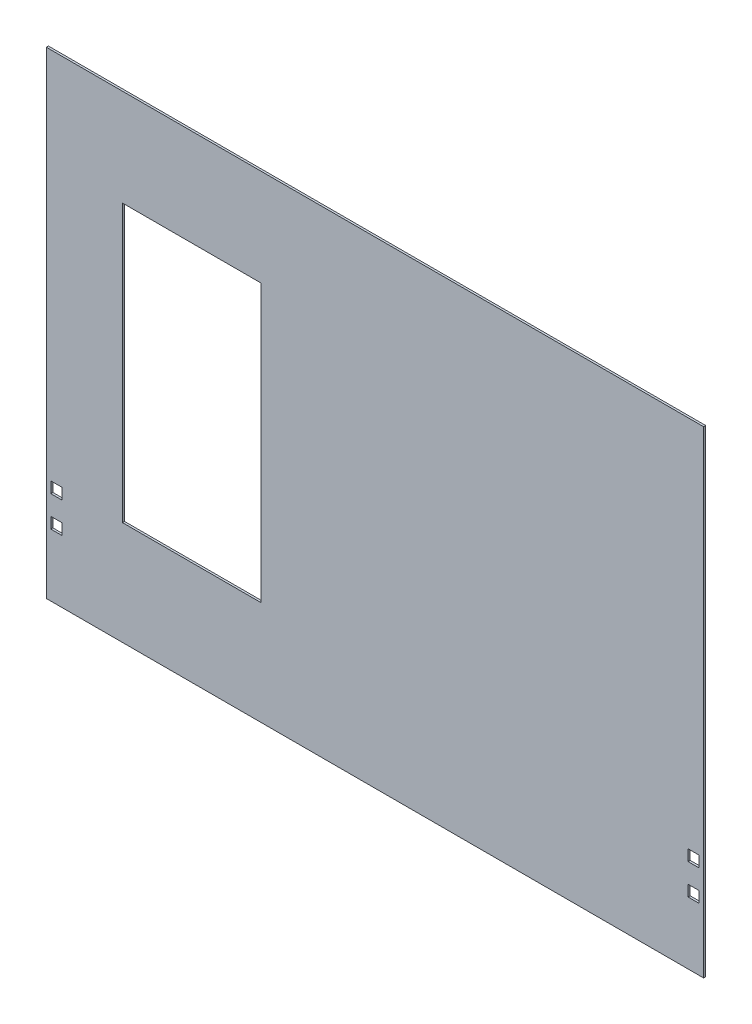
ISO-10303-21;
HEADER;
FILE_DESCRIPTION(('STEP AP214'),'2;1');
FILE_NAME('part.step','',(''),(''),'','','');
FILE_SCHEMA(('AUTOMOTIVE_DESIGN { 1 0 10303 214 1 1 1 1 }'));
ENDSEC;
DATA;
#1=APPLICATION_CONTEXT('core data for automotive mechanical design processes');
#2=APPLICATION_PROTOCOL_DEFINITION('international standard','automotive_design',2000,#1);
#3=PRODUCT_CONTEXT('',#1,'mechanical');
#4=PRODUCT('Part','Part','',(#3));
#5=PRODUCT_RELATED_PRODUCT_CATEGORY('part','',(#4));
#6=PRODUCT_DEFINITION_FORMATION('','',#4);
#7=PRODUCT_DEFINITION_CONTEXT('part definition',#1,'design');
#8=PRODUCT_DEFINITION('design','',#6,#7);
#9=PRODUCT_DEFINITION_SHAPE('','',#8);
#10=(LENGTH_UNIT() NAMED_UNIT(*) SI_UNIT(.MILLI.,.METRE.));
#11=(NAMED_UNIT(*) PLANE_ANGLE_UNIT() SI_UNIT($,.RADIAN.));
#12=(NAMED_UNIT(*) SI_UNIT($,.STERADIAN.) SOLID_ANGLE_UNIT());
#13=UNCERTAINTY_MEASURE_WITH_UNIT(LENGTH_MEASURE(1.E-05),#10,'distance_accuracy_value','');
#14=(GEOMETRIC_REPRESENTATION_CONTEXT(3) GLOBAL_UNCERTAINTY_ASSIGNED_CONTEXT((#13)) GLOBAL_UNIT_ASSIGNED_CONTEXT((#10,
#11,#12)) REPRESENTATION_CONTEXT('',''));
#15=CARTESIAN_POINT('',(0.,0.,0.));
#16=DIRECTION('',(0.,0.,1.));
#17=DIRECTION('',(1.,0.,0.));
#18=AXIS2_PLACEMENT_3D('',#15,#16,#17);
#19=CARTESIAN_POINT('',(0.,0.,-3.));
#20=DIRECTION('',(0.,0.,-1.));
#21=DIRECTION('',(-1.,0.,0.));
#22=AXIS2_PLACEMENT_3D('',#19,#20,#21);
#23=PLANE('',#22);
#24=DIRECTION('',(0.,-1.,0.));
#25=VECTOR('',#24,1.);
#26=CARTESIAN_POINT('',(-365.000000000001,260.,-3.));
#27=LINE('',#26,#25);
#28=CARTESIAN_POINT('',(-365.000000000001,260.,-3.));
#29=VERTEX_POINT('',#28);
#30=CARTESIAN_POINT('',(-365.000000000001,-140.,-3.));
#31=VERTEX_POINT('',#30);
#32=EDGE_CURVE('E426',#29,#31,#27,.T.);
#33=ORIENTED_EDGE('',*,*,#32,.T.);
#34=DIRECTION('',(1.,0.,0.));
#35=VECTOR('',#34,1.);
#36=CARTESIAN_POINT('',(-365.000000000001,-140.,-3.));
#37=LINE('',#36,#35);
#38=CARTESIAN_POINT('',(-165.000000000001,-140.,-3.));
#39=VERTEX_POINT('',#38);
#40=EDGE_CURVE('E449',#31,#39,#37,.T.);
#41=ORIENTED_EDGE('',*,*,#40,.T.);
#42=DIRECTION('',(0.,1.,0.));
#43=VECTOR('',#42,1.);
#44=CARTESIAN_POINT('',(-165.000000000001,260.,-3.));
#45=LINE('',#44,#43);
#46=CARTESIAN_POINT('',(-165.000000000001,260.,-3.));
#47=VERTEX_POINT('',#46);
#48=EDGE_CURVE('E339',#39,#47,#45,.T.);
#49=ORIENTED_EDGE('',*,*,#48,.T.);
#50=DIRECTION('',(-1.,0.,0.));
#51=VECTOR('',#50,1.);
#52=CARTESIAN_POINT('',(-365.000000000001,260.,-3.));
#53=LINE('',#52,#51);
#54=EDGE_CURVE('E422',#47,#29,#53,.T.);
#55=ORIENTED_EDGE('',*,*,#54,.T.);
#56=EDGE_LOOP('',(#33,#41,#49,#55));
#57=FACE_BOUND('',#56,.T.);
#58=DIRECTION('',(-1.,0.,0.));
#59=VECTOR('',#58,1.);
#60=CARTESIAN_POINT('',(-475.,-290.,-3.));
#61=LINE('',#60,#59);
#62=CARTESIAN_POINT('',(475.,-290.,-3.));
#63=VERTEX_POINT('',#62);
#64=CARTESIAN_POINT('',(-475.,-290.,-3.));
#65=VERTEX_POINT('',#64);
#66=EDGE_CURVE('E462',#63,#65,#61,.T.);
#67=ORIENTED_EDGE('',*,*,#66,.T.);
#68=DIRECTION('',(0.,-1.,0.));
#69=VECTOR('',#68,1.);
#70=CARTESIAN_POINT('',(-475.,-400.,-3.));
#71=LINE('',#70,#69);
#72=CARTESIAN_POINT('',(-475.,400.,-3.));
#73=VERTEX_POINT('',#72);
#74=EDGE_CURVE('E485',#73,#65,#71,.T.);
#75=ORIENTED_EDGE('',*,*,#74,.F.);
#76=DIRECTION('',(-1.,0.,0.));
#77=VECTOR('',#76,1.);
#78=CARTESIAN_POINT('',(-475.,400.,-3.));
#79=LINE('',#78,#77);
#80=CARTESIAN_POINT('',(475.,400.,-3.));
#81=VERTEX_POINT('',#80);
#82=EDGE_CURVE('E480',#81,#73,#79,.T.);
#83=ORIENTED_EDGE('',*,*,#82,.F.);
#84=DIRECTION('',(0.,1.,0.));
#85=VECTOR('',#84,1.);
#86=CARTESIAN_POINT('',(475.,-400.,-3.));
#87=LINE('',#86,#85);
#88=EDGE_CURVE('E477',#63,#81,#87,.T.);
#89=ORIENTED_EDGE('',*,*,#88,.F.);
#90=EDGE_LOOP('',(#67,#75,#83,#89));
#91=FACE_BOUND('',#90,.T.);
#92=DIRECTION('',(0.,-1.,0.));
#93=VECTOR('',#92,1.);
#94=CARTESIAN_POINT('',(468.5,-139.5,-3.));
#95=LINE('',#94,#93);
#96=CARTESIAN_POINT('',(468.5,-139.5,-3.));
#97=VERTEX_POINT('',#96);
#98=CARTESIAN_POINT('',(468.5,-155.5,-3.));
#99=VERTEX_POINT('',#98);
#100=EDGE_CURVE('E402',#97,#99,#95,.T.);
#101=ORIENTED_EDGE('',*,*,#100,.F.);
#102=DIRECTION('',(1.,0.,0.));
#103=VECTOR('',#102,1.);
#104=CARTESIAN_POINT('',(452.5,-139.5,-3.));
#105=LINE('',#104,#103);
#106=CARTESIAN_POINT('',(452.5,-139.5,-3.));
#107=VERTEX_POINT('',#106);
#108=EDGE_CURVE('E406',#107,#97,#105,.T.);
#109=ORIENTED_EDGE('',*,*,#108,.F.);
#110=DIRECTION('',(0.,1.,0.));
#111=VECTOR('',#110,1.);
#112=CARTESIAN_POINT('',(452.5,-155.5,-3.));
#113=LINE('',#112,#111);
#114=CARTESIAN_POINT('',(452.5,-155.5,-3.));
#115=VERTEX_POINT('',#114);
#116=EDGE_CURVE('E367',#115,#107,#113,.T.);
#117=ORIENTED_EDGE('',*,*,#116,.F.);
#118=DIRECTION('',(-1.,0.,0.));
#119=VECTOR('',#118,1.);
#120=CARTESIAN_POINT('',(468.5,-155.5,-3.));
#121=LINE('',#120,#119);
#122=EDGE_CURVE('E360',#99,#115,#121,.T.);
#123=ORIENTED_EDGE('',*,*,#122,.F.);
#124=EDGE_LOOP('',(#101,#109,#117,#123));
#125=FACE_BOUND('',#124,.T.);
#126=DIRECTION('',(0.,-1.,0.));
#127=VECTOR('',#126,1.);
#128=CARTESIAN_POINT('',(468.5,-183.850348269495,-3.));
#129=LINE('',#128,#127);
#130=CARTESIAN_POINT('',(468.5,-183.850348269495,-3.));
#131=VERTEX_POINT('',#130);
#132=CARTESIAN_POINT('',(468.5,-199.850348269495,-3.));
#133=VERTEX_POINT('',#132);
#134=EDGE_CURVE('E340',#131,#133,#129,.T.);
#135=ORIENTED_EDGE('',*,*,#134,.F.);
#136=DIRECTION('',(1.,0.,0.));
#137=VECTOR('',#136,1.);
#138=CARTESIAN_POINT('',(452.5,-183.850348269495,-3.));
#139=LINE('',#138,#137);
#140=CARTESIAN_POINT('',(452.5,-183.850348269495,-3.));
#141=VERTEX_POINT('',#140);
#142=EDGE_CURVE('E344',#141,#131,#139,.T.);
#143=ORIENTED_EDGE('',*,*,#142,.F.);
#144=DIRECTION('',(0.,1.,0.));
#145=VECTOR('',#144,1.);
#146=CARTESIAN_POINT('',(452.5,-199.850348269495,-3.));
#147=LINE('',#146,#145);
#148=CARTESIAN_POINT('',(452.5,-199.850348269495,-3.));
#149=VERTEX_POINT('',#148);
#150=EDGE_CURVE('E301',#149,#141,#147,.T.);
#151=ORIENTED_EDGE('',*,*,#150,.F.);
#152=DIRECTION('',(-1.,0.,0.));
#153=VECTOR('',#152,1.);
#154=CARTESIAN_POINT('',(468.5,-199.850348269495,-3.));
#155=LINE('',#154,#153);
#156=EDGE_CURVE('E333',#133,#149,#155,.T.);
#157=ORIENTED_EDGE('',*,*,#156,.F.);
#158=EDGE_LOOP('',(#135,#143,#151,#157));
#159=FACE_BOUND('',#158,.T.);
#160=DIRECTION('',(0.,1.,0.));
#161=VECTOR('',#160,1.);
#162=CARTESIAN_POINT('',(-452.5,-155.5,-3.));
#163=LINE('',#162,#161);
#164=CARTESIAN_POINT('',(-452.5,-155.5,-3.));
#165=VERTEX_POINT('',#164);
#166=CARTESIAN_POINT('',(-452.5,-139.5,-3.));
#167=VERTEX_POINT('',#166);
#168=EDGE_CURVE('E251',#165,#167,#163,.T.);
#169=ORIENTED_EDGE('',*,*,#168,.T.);
#170=DIRECTION('',(-1.,0.,0.));
#171=VECTOR('',#170,1.);
#172=CARTESIAN_POINT('',(-452.5,-139.5,-3.));
#173=LINE('',#172,#171);
#174=CARTESIAN_POINT('',(-468.5,-139.5,-3.));
#175=VERTEX_POINT('',#174);
#176=EDGE_CURVE('E64',#167,#175,#173,.T.);
#177=ORIENTED_EDGE('',*,*,#176,.T.);
#178=DIRECTION('',(0.,-1.,0.));
#179=VECTOR('',#178,1.);
#180=CARTESIAN_POINT('',(-468.5,-139.5,-3.));
#181=LINE('',#180,#179);
#182=CARTESIAN_POINT('',(-468.5,-155.5,-3.));
#183=VERTEX_POINT('',#182);
#184=EDGE_CURVE('E283',#175,#183,#181,.T.);
#185=ORIENTED_EDGE('',*,*,#184,.T.);
#186=DIRECTION('',(1.,0.,0.));
#187=VECTOR('',#186,1.);
#188=CARTESIAN_POINT('',(-468.5,-155.5,-3.));
#189=LINE('',#188,#187);
#190=EDGE_CURVE('E246',#183,#165,#189,.T.);
#191=ORIENTED_EDGE('',*,*,#190,.T.);
#192=EDGE_LOOP('',(#169,#177,#185,#191));
#193=FACE_BOUND('',#192,.T.);
#194=DIRECTION('',(0.,1.,0.));
#195=VECTOR('',#194,1.);
#196=CARTESIAN_POINT('',(-452.5,-199.850348269495,-3.));
#197=LINE('',#196,#195);
#198=CARTESIAN_POINT('',(-452.5,-199.850348269495,-3.));
#199=VERTEX_POINT('',#198);
#200=CARTESIAN_POINT('',(-452.5,-183.850348269495,-3.));
#201=VERTEX_POINT('',#200);
#202=EDGE_CURVE('E204',#199,#201,#197,.T.);
#203=ORIENTED_EDGE('',*,*,#202,.T.);
#204=DIRECTION('',(-1.,0.,0.));
#205=VECTOR('',#204,1.);
#206=CARTESIAN_POINT('',(-452.5,-183.850348269495,-3.));
#207=LINE('',#206,#205);
#208=CARTESIAN_POINT('',(-468.5,-183.850348269495,-3.));
#209=VERTEX_POINT('',#208);
#210=EDGE_CURVE('E56',#201,#209,#207,.T.);
#211=ORIENTED_EDGE('',*,*,#210,.T.);
#212=DIRECTION('',(0.,-1.,0.));
#213=VECTOR('',#212,1.);
#214=CARTESIAN_POINT('',(-468.5,-183.850348269495,-3.));
#215=LINE('',#214,#213);
#216=CARTESIAN_POINT('',(-468.5,-199.850348269495,-3.));
#217=VERTEX_POINT('',#216);
#218=EDGE_CURVE('E224',#209,#217,#215,.T.);
#219=ORIENTED_EDGE('',*,*,#218,.T.);
#220=DIRECTION('',(1.,0.,0.));
#221=VECTOR('',#220,1.);
#222=CARTESIAN_POINT('',(-468.5,-199.850348269495,-3.));
#223=LINE('',#222,#221);
#224=EDGE_CURVE('E217',#217,#199,#223,.T.);
#225=ORIENTED_EDGE('',*,*,#224,.T.);
#226=EDGE_LOOP('',(#203,#211,#219,#225));
#227=FACE_BOUND('',#226,.T.);
#228=ADVANCED_FACE('F40',(#57,#91,#125,#159,#193,#227),#23,.T.);
#229=CARTESIAN_POINT('',(0.,0.,0.));
#230=DIRECTION('',(0.,0.,-1.));
#231=DIRECTION('',(-1.,0.,0.));
#232=AXIS2_PLACEMENT_3D('',#229,#230,#231);
#233=PLANE('',#232);
#234=CARTESIAN_POINT('',(-452.5,-139.5,0.));
#235=CARTESIAN_POINT('',(-468.5,-139.5,0.));
#236=B_SPLINE_CURVE_WITH_KNOTS('',1,(#234,#235),.UNSPECIFIED.,.F.,.F.,(2,2),(0.,0.25),.UNSPECIFIED.);
#237=CARTESIAN_POINT('',(-452.5,-139.5,0.));
#238=VERTEX_POINT('',#237);
#239=CARTESIAN_POINT('',(-468.5,-139.5,0.));
#240=VERTEX_POINT('',#239);
#241=EDGE_CURVE('E270',#238,#240,#236,.T.);
#242=ORIENTED_EDGE('',*,*,#241,.F.);
#243=CARTESIAN_POINT('',(-452.5,-155.5,0.));
#244=CARTESIAN_POINT('',(-452.5,-139.5,0.));
#245=B_SPLINE_CURVE_WITH_KNOTS('',1,(#243,#244),.UNSPECIFIED.,.F.,.F.,(2,2),(0.75,1.),.UNSPECIFIED.);
#246=CARTESIAN_POINT('',(-452.5,-155.5,0.));
#247=VERTEX_POINT('',#246);
#248=EDGE_CURVE('E247',#247,#238,#245,.T.);
#249=ORIENTED_EDGE('',*,*,#248,.F.);
#250=CARTESIAN_POINT('',(-468.5,-155.5,0.));
#251=CARTESIAN_POINT('',(-452.5,-155.5,0.));
#252=B_SPLINE_CURVE_WITH_KNOTS('',1,(#250,#251),.UNSPECIFIED.,.F.,.F.,(2,2),(0.5,0.75),.UNSPECIFIED.);
#253=CARTESIAN_POINT('',(-468.5,-155.5,0.));
#254=VERTEX_POINT('',#253);
#255=EDGE_CURVE('E253',#254,#247,#252,.T.);
#256=ORIENTED_EDGE('',*,*,#255,.F.);
#257=CARTESIAN_POINT('',(-468.5,-139.5,0.));
#258=CARTESIAN_POINT('',(-468.5,-155.5,0.));
#259=B_SPLINE_CURVE_WITH_KNOTS('',1,(#257,#258),.UNSPECIFIED.,.F.,.F.,(2,2),(0.25,0.5),.UNSPECIFIED.);
#260=EDGE_CURVE('E262',#240,#254,#259,.T.);
#261=ORIENTED_EDGE('',*,*,#260,.F.);
#262=EDGE_LOOP('',(#242,#249,#256,#261));
#263=FACE_BOUND('',#262,.T.);
#264=CARTESIAN_POINT('',(452.5,-139.5,0.));
#265=CARTESIAN_POINT('',(468.5,-139.5,0.));
#266=B_SPLINE_CURVE_WITH_KNOTS('',1,(#264,#265),.UNSPECIFIED.,.F.,.F.,(2,2),(0.,0.25),.UNSPECIFIED.);
#267=CARTESIAN_POINT('',(452.5,-139.5,0.));
#268=VERTEX_POINT('',#267);
#269=CARTESIAN_POINT('',(468.5,-139.5,0.));
#270=VERTEX_POINT('',#269);
#271=EDGE_CURVE('E229',#268,#270,#266,.T.);
#272=ORIENTED_EDGE('',*,*,#271,.T.);
#273=CARTESIAN_POINT('',(468.5,-139.5,0.));
#274=CARTESIAN_POINT('',(468.5,-155.5,0.));
#275=B_SPLINE_CURVE_WITH_KNOTS('',1,(#273,#274),.UNSPECIFIED.,.F.,.F.,(2,2),(0.25,0.5),.UNSPECIFIED.);
#276=CARTESIAN_POINT('',(468.5,-155.5,0.));
#277=VERTEX_POINT('',#276);
#278=EDGE_CURVE('E379',#270,#277,#275,.T.);
#279=ORIENTED_EDGE('',*,*,#278,.T.);
#280=CARTESIAN_POINT('',(468.5,-155.5,0.));
#281=CARTESIAN_POINT('',(452.5,-155.5,0.));
#282=B_SPLINE_CURVE_WITH_KNOTS('',1,(#280,#281),.UNSPECIFIED.,.F.,.F.,(2,2),(0.5,0.75),.UNSPECIFIED.);
#283=CARTESIAN_POINT('',(452.5,-155.5,0.));
#284=VERTEX_POINT('',#283);
#285=EDGE_CURVE('E369',#277,#284,#282,.T.);
#286=ORIENTED_EDGE('',*,*,#285,.T.);
#287=CARTESIAN_POINT('',(452.5,-155.5,0.));
#288=CARTESIAN_POINT('',(452.5,-139.5,0.));
#289=B_SPLINE_CURVE_WITH_KNOTS('',1,(#287,#288),.UNSPECIFIED.,.F.,.F.,(2,2),(0.75,1.),.UNSPECIFIED.);
#290=EDGE_CURVE('E361',#284,#268,#289,.T.);
#291=ORIENTED_EDGE('',*,*,#290,.T.);
#292=EDGE_LOOP('',(#272,#279,#286,#291));
#293=FACE_BOUND('',#292,.T.);
#294=DIRECTION('',(1.,0.,0.));
#295=VECTOR('',#294,1.);
#296=CARTESIAN_POINT('',(-365.000000000001,-140.,0.));
#297=LINE('',#296,#295);
#298=CARTESIAN_POINT('',(-365.000000000001,-140.,0.));
#299=VERTEX_POINT('',#298);
#300=CARTESIAN_POINT('',(-165.000000000001,-140.,0.));
#301=VERTEX_POINT('',#300);
#302=EDGE_CURVE('E433',#299,#301,#297,.T.);
#303=ORIENTED_EDGE('',*,*,#302,.F.);
#304=DIRECTION('',(0.,-1.,0.));
#305=VECTOR('',#304,1.);
#306=CARTESIAN_POINT('',(-365.000000000001,260.,0.));
#307=LINE('',#306,#305);
#308=CARTESIAN_POINT('',(-365.000000000001,260.,0.));
#309=VERTEX_POINT('',#308);
#310=EDGE_CURVE('E430',#309,#299,#307,.T.);
#311=ORIENTED_EDGE('',*,*,#310,.F.);
#312=DIRECTION('',(-1.,0.,0.));
#313=VECTOR('',#312,1.);
#314=CARTESIAN_POINT('',(-365.000000000001,260.,0.));
#315=LINE('',#314,#313);
#316=CARTESIAN_POINT('',(-165.000000000001,260.,0.));
#317=VERTEX_POINT('',#316);
#318=EDGE_CURVE('E441',#317,#309,#315,.T.);
#319=ORIENTED_EDGE('',*,*,#318,.F.);
#320=DIRECTION('',(0.,1.,0.));
#321=VECTOR('',#320,1.);
#322=CARTESIAN_POINT('',(-165.000000000001,260.,0.));
#323=LINE('',#322,#321);
#324=EDGE_CURVE('E437',#301,#317,#323,.T.);
#325=ORIENTED_EDGE('',*,*,#324,.F.);
#326=EDGE_LOOP('',(#303,#311,#319,#325));
#327=FACE_BOUND('',#326,.T.);
#328=DIRECTION('',(0.,-1.,0.));
#329=VECTOR('',#328,1.);
#330=CARTESIAN_POINT('',(-475.,-400.,0.));
#331=LINE('',#330,#329);
#332=CARTESIAN_POINT('',(-475.,400.,0.));
#333=VERTEX_POINT('',#332);
#334=CARTESIAN_POINT('',(-475.,-290.,0.));
#335=VERTEX_POINT('',#334);
#336=EDGE_CURVE('E481',#333,#335,#331,.T.);
#337=ORIENTED_EDGE('',*,*,#336,.T.);
#338=DIRECTION('',(-1.,0.,0.));
#339=VECTOR('',#338,1.);
#340=CARTESIAN_POINT('',(-475.,-290.,0.));
#341=LINE('',#340,#339);
#342=CARTESIAN_POINT('',(475.,-290.,0.));
#343=VERTEX_POINT('',#342);
#344=EDGE_CURVE('E466',#343,#335,#341,.T.);
#345=ORIENTED_EDGE('',*,*,#344,.F.);
#346=DIRECTION('',(0.,1.,0.));
#347=VECTOR('',#346,1.);
#348=CARTESIAN_POINT('',(475.,-400.,0.));
#349=LINE('',#348,#347);
#350=CARTESIAN_POINT('',(475.,400.,0.));
#351=VERTEX_POINT('',#350);
#352=EDGE_CURVE('E474',#343,#351,#349,.T.);
#353=ORIENTED_EDGE('',*,*,#352,.T.);
#354=DIRECTION('',(-1.,0.,0.));
#355=VECTOR('',#354,1.);
#356=CARTESIAN_POINT('',(-475.,400.,0.));
#357=LINE('',#356,#355);
#358=EDGE_CURVE('E491',#351,#333,#357,.T.);
#359=ORIENTED_EDGE('',*,*,#358,.T.);
#360=EDGE_LOOP('',(#337,#345,#353,#359));
#361=FACE_BOUND('',#360,.T.);
#362=CARTESIAN_POINT('',(452.5,-183.850348269495,0.));
#363=CARTESIAN_POINT('',(468.5,-183.850348269495,0.));
#364=B_SPLINE_CURVE_WITH_KNOTS('',1,(#362,#363),.UNSPECIFIED.,.F.,.F.,(2,2),(0.,0.25),.UNSPECIFIED.);
#365=CARTESIAN_POINT('',(452.5,-183.850348269495,0.));
#366=VERTEX_POINT('',#365);
#367=CARTESIAN_POINT('',(468.5,-183.850348269495,0.));
#368=VERTEX_POINT('',#367);
#369=EDGE_CURVE('E323',#366,#368,#364,.T.);
#370=ORIENTED_EDGE('',*,*,#369,.T.);
#371=CARTESIAN_POINT('',(468.5,-183.850348269495,0.));
#372=CARTESIAN_POINT('',(468.5,-199.850348269495,0.));
#373=B_SPLINE_CURVE_WITH_KNOTS('',1,(#371,#372),.UNSPECIFIED.,.F.,.F.,(2,2),(0.25,0.5),.UNSPECIFIED.);
#374=CARTESIAN_POINT('',(468.5,-199.850348269495,0.));
#375=VERTEX_POINT('',#374);
#376=EDGE_CURVE('E313',#368,#375,#373,.T.);
#377=ORIENTED_EDGE('',*,*,#376,.T.);
#378=CARTESIAN_POINT('',(468.5,-199.850348269495,0.));
#379=CARTESIAN_POINT('',(452.5,-199.850348269495,0.));
#380=B_SPLINE_CURVE_WITH_KNOTS('',1,(#378,#379),.UNSPECIFIED.,.F.,.F.,(2,2),(0.5,0.75),.UNSPECIFIED.);
#381=CARTESIAN_POINT('',(452.5,-199.850348269495,0.));
#382=VERTEX_POINT('',#381);
#383=EDGE_CURVE('E303',#375,#382,#380,.T.);
#384=ORIENTED_EDGE('',*,*,#383,.T.);
#385=CARTESIAN_POINT('',(452.5,-199.850348269495,0.));
#386=CARTESIAN_POINT('',(452.5,-183.850348269495,0.));
#387=B_SPLINE_CURVE_WITH_KNOTS('',1,(#385,#386),.UNSPECIFIED.,.F.,.F.,(2,2),(0.75,1.),.UNSPECIFIED.);
#388=EDGE_CURVE('E295',#382,#366,#387,.T.);
#389=ORIENTED_EDGE('',*,*,#388,.T.);
#390=EDGE_LOOP('',(#370,#377,#384,#389));
#391=FACE_BOUND('',#390,.T.);
#392=CARTESIAN_POINT('',(-452.5,-183.850348269495,0.));
#393=CARTESIAN_POINT('',(-468.5,-183.850348269495,0.));
#394=B_SPLINE_CURVE_WITH_KNOTS('',1,(#392,#393),.UNSPECIFIED.,.F.,.F.,(2,2),(0.,0.25),.UNSPECIFIED.);
#395=CARTESIAN_POINT('',(-452.5,-183.850348269495,0.));
#396=VERTEX_POINT('',#395);
#397=CARTESIAN_POINT('',(-468.5,-183.850348269495,0.));
#398=VERTEX_POINT('',#397);
#399=EDGE_CURVE('E233',#396,#398,#394,.T.);
#400=ORIENTED_EDGE('',*,*,#399,.F.);
#401=CARTESIAN_POINT('',(-452.5,-199.850348269495,0.));
#402=CARTESIAN_POINT('',(-452.5,-183.850348269495,0.));
#403=B_SPLINE_CURVE_WITH_KNOTS('',1,(#401,#402),.UNSPECIFIED.,.F.,.F.,(2,2),(0.75,1.),.UNSPECIFIED.);
#404=CARTESIAN_POINT('',(-452.5,-199.850348269495,0.));
#405=VERTEX_POINT('',#404);
#406=EDGE_CURVE('E212',#405,#396,#403,.T.);
#407=ORIENTED_EDGE('',*,*,#406,.F.);
#408=CARTESIAN_POINT('',(-468.5,-199.850348269495,0.));
#409=CARTESIAN_POINT('',(-452.5,-199.850348269495,0.));
#410=B_SPLINE_CURVE_WITH_KNOTS('',1,(#408,#409),.UNSPECIFIED.,.F.,.F.,(2,2),(0.5,0.75),.UNSPECIFIED.);
#411=CARTESIAN_POINT('',(-468.5,-199.850348269495,0.));
#412=VERTEX_POINT('',#411);
#413=EDGE_CURVE('E220',#412,#405,#410,.T.);
#414=ORIENTED_EDGE('',*,*,#413,.F.);
#415=CARTESIAN_POINT('',(-468.5,-183.850348269495,0.));
#416=CARTESIAN_POINT('',(-468.5,-199.850348269495,0.));
#417=B_SPLINE_CURVE_WITH_KNOTS('',1,(#415,#416),.UNSPECIFIED.,.F.,.F.,(2,2),(0.25,0.5),.UNSPECIFIED.);
#418=EDGE_CURVE('E242',#398,#412,#417,.T.);
#419=ORIENTED_EDGE('',*,*,#418,.F.);
#420=EDGE_LOOP('',(#400,#407,#414,#419));
#421=FACE_BOUND('',#420,.T.);
#422=ADVANCED_FACE('F502',(#263,#293,#327,#361,#391,#421),#233,.F.);
#423=CARTESIAN_POINT('',(475.,-400.,-3.));
#424=DIRECTION('',(1.,0.,0.));
#425=DIRECTION('',(0.,0.,-1.));
#426=AXIS2_PLACEMENT_3D('',#423,#424,#425);
#427=PLANE('',#426);
#428=DIRECTION('',(0.,0.,1.));
#429=VECTOR('',#428,1.);
#430=CARTESIAN_POINT('',(475.,-290.,-3.001));
#431=LINE('',#430,#429);
#432=EDGE_CURVE('E469',#63,#343,#431,.T.);
#433=ORIENTED_EDGE('',*,*,#432,.F.);
#434=ORIENTED_EDGE('',*,*,#88,.T.);
#435=DIRECTION('',(0.,0.,1.));
#436=VECTOR('',#435,1.);
#437=CARTESIAN_POINT('',(475.,400.,-3.));
#438=LINE('',#437,#436);
#439=EDGE_CURVE('E44',#81,#351,#438,.T.);
#440=ORIENTED_EDGE('',*,*,#439,.T.);
#441=ORIENTED_EDGE('',*,*,#352,.F.);
#442=EDGE_LOOP('',(#433,#434,#440,#441));
#443=FACE_BOUND('',#442,.T.);
#444=ADVANCED_FACE('F42',(#443),#427,.T.);
#445=CARTESIAN_POINT('',(-475.,-400.,-3.));
#446=DIRECTION('',(-1.,0.,0.));
#447=DIRECTION('',(0.,0.,1.));
#448=AXIS2_PLACEMENT_3D('',#445,#446,#447);
#449=PLANE('',#448);
#450=DIRECTION('',(0.,0.,1.));
#451=VECTOR('',#450,1.);
#452=CARTESIAN_POINT('',(-475.,-290.,-3.001));
#453=LINE('',#452,#451);
#454=EDGE_CURVE('E470',#65,#335,#453,.T.);
#455=ORIENTED_EDGE('',*,*,#454,.T.);
#456=ORIENTED_EDGE('',*,*,#336,.F.);
#457=DIRECTION('',(0.,0.,1.));
#458=VECTOR('',#457,1.);
#459=CARTESIAN_POINT('',(-475.,400.,-3.));
#460=LINE('',#459,#458);
#461=EDGE_CURVE('E11',#73,#333,#460,.T.);
#462=ORIENTED_EDGE('',*,*,#461,.F.);
#463=ORIENTED_EDGE('',*,*,#74,.T.);
#464=EDGE_LOOP('',(#455,#456,#462,#463));
#465=FACE_BOUND('',#464,.T.);
#466=ADVANCED_FACE('F507',(#465),#449,.T.);
#467=CARTESIAN_POINT('',(-475.,400.,-3.));
#468=DIRECTION('',(0.,1.,0.));
#469=DIRECTION('',(0.,0.,1.));
#470=AXIS2_PLACEMENT_3D('',#467,#468,#469);
#471=PLANE('',#470);
#472=ORIENTED_EDGE('',*,*,#358,.F.);
#473=ORIENTED_EDGE('',*,*,#439,.F.);
#474=ORIENTED_EDGE('',*,*,#82,.T.);
#475=ORIENTED_EDGE('',*,*,#461,.T.);
#476=EDGE_LOOP('',(#472,#473,#474,#475));
#477=FACE_BOUND('',#476,.T.);
#478=ADVANCED_FACE('F520',(#477),#471,.T.);
#479=CARTESIAN_POINT('',(-475.,-290.,-3.001));
#480=DIRECTION('',(0.,1.,0.));
#481=DIRECTION('',(0.,0.,1.));
#482=AXIS2_PLACEMENT_3D('',#479,#480,#481);
#483=PLANE('',#482);
#484=ORIENTED_EDGE('',*,*,#432,.T.);
#485=ORIENTED_EDGE('',*,*,#344,.T.);
#486=ORIENTED_EDGE('',*,*,#454,.F.);
#487=ORIENTED_EDGE('',*,*,#66,.F.);
#488=EDGE_LOOP('',(#484,#485,#486,#487));
#489=FACE_BOUND('',#488,.T.);
#490=ADVANCED_FACE('F510',(#489),#483,.F.);
#491=CARTESIAN_POINT('',(-365.000000000001,260.,-3.001));
#492=DIRECTION('',(-1.,0.,0.));
#493=DIRECTION('',(0.,-1.,0.));
#494=AXIS2_PLACEMENT_3D('',#491,#492,#493);
#495=PLANE('',#494);
#496=DIRECTION('',(0.,0.,1.));
#497=VECTOR('',#496,1.);
#498=CARTESIAN_POINT('',(-365.000000000001,260.,-3.001));
#499=LINE('',#498,#497);
#500=EDGE_CURVE('E446',#29,#309,#499,.T.);
#501=ORIENTED_EDGE('',*,*,#500,.T.);
#502=ORIENTED_EDGE('',*,*,#310,.T.);
#503=DIRECTION('',(0.,0.,1.));
#504=VECTOR('',#503,1.);
#505=CARTESIAN_POINT('',(-365.000000000001,-140.,-3.001));
#506=LINE('',#505,#504);
#507=EDGE_CURVE('E445',#31,#299,#506,.T.);
#508=ORIENTED_EDGE('',*,*,#507,.F.);
#509=ORIENTED_EDGE('',*,*,#32,.F.);
#510=EDGE_LOOP('',(#501,#502,#508,#509));
#511=FACE_BOUND('',#510,.T.);
#512=ADVANCED_FACE('F527',(#511),#495,.F.);
#513=CARTESIAN_POINT('',(-365.000000000001,260.,-3.001));
#514=DIRECTION('',(0.,1.,0.));
#515=DIRECTION('',(0.,0.,1.));
#516=AXIS2_PLACEMENT_3D('',#513,#514,#515);
#517=PLANE('',#516);
#518=DIRECTION('',(0.,0.,1.));
#519=VECTOR('',#518,1.);
#520=CARTESIAN_POINT('',(-165.000000000001,260.,-3.001));
#521=LINE('',#520,#519);
#522=EDGE_CURVE('E450',#47,#317,#521,.T.);
#523=ORIENTED_EDGE('',*,*,#522,.T.);
#524=ORIENTED_EDGE('',*,*,#318,.T.);
#525=ORIENTED_EDGE('',*,*,#500,.F.);
#526=ORIENTED_EDGE('',*,*,#54,.F.);
#527=EDGE_LOOP('',(#523,#524,#525,#526));
#528=FACE_BOUND('',#527,.T.);
#529=ADVANCED_FACE('F541',(#528),#517,.F.);
#530=CARTESIAN_POINT('',(-165.000000000001,260.,-3.001));
#531=DIRECTION('',(1.,0.,0.));
#532=DIRECTION('',(0.,1.,0.));
#533=AXIS2_PLACEMENT_3D('',#530,#531,#532);
#534=PLANE('',#533);
#535=DIRECTION('',(0.,0.,1.));
#536=VECTOR('',#535,1.);
#537=CARTESIAN_POINT('',(-165.000000000001,-140.,-3.001));
#538=LINE('',#537,#536);
#539=EDGE_CURVE('E453',#39,#301,#538,.T.);
#540=ORIENTED_EDGE('',*,*,#539,.T.);
#541=ORIENTED_EDGE('',*,*,#324,.T.);
#542=ORIENTED_EDGE('',*,*,#522,.F.);
#543=ORIENTED_EDGE('',*,*,#48,.F.);
#544=EDGE_LOOP('',(#540,#541,#542,#543));
#545=FACE_BOUND('',#544,.T.);
#546=ADVANCED_FACE('F547',(#545),#534,.F.);
#547=CARTESIAN_POINT('',(-365.000000000001,-140.,-3.001));
#548=DIRECTION('',(0.,-1.,0.));
#549=DIRECTION('',(0.,0.,-1.));
#550=AXIS2_PLACEMENT_3D('',#547,#548,#549);
#551=PLANE('',#550);
#552=ORIENTED_EDGE('',*,*,#507,.T.);
#553=ORIENTED_EDGE('',*,*,#302,.T.);
#554=ORIENTED_EDGE('',*,*,#539,.F.);
#555=ORIENTED_EDGE('',*,*,#40,.F.);
#556=EDGE_LOOP('',(#552,#553,#554,#555));
#557=FACE_BOUND('',#556,.T.);
#558=ADVANCED_FACE('F543',(#557),#551,.F.);
#559=CARTESIAN_POINT('',(452.5,-139.5,-6.));
#560=DIRECTION('',(0.,-1.,0.));
#561=DIRECTION('',(0.,0.,-1.));
#562=AXIS2_PLACEMENT_3D('',#559,#560,#561);
#563=PLANE('',#562);
#564=ORIENTED_EDGE('',*,*,#108,.T.);
#565=DIRECTION('',(0.,0.,1.));
#566=VECTOR('',#565,1.);
#567=CARTESIAN_POINT('',(468.5,-139.5,-6.));
#568=LINE('',#567,#566);
#569=EDGE_CURVE('E388',#97,#270,#568,.T.);
#570=ORIENTED_EDGE('',*,*,#569,.T.);
#571=ORIENTED_EDGE('',*,*,#271,.F.);
#572=DIRECTION('',(0.,0.,1.));
#573=VECTOR('',#572,1.);
#574=CARTESIAN_POINT('',(452.5,-139.5,-6.));
#575=LINE('',#574,#573);
#576=EDGE_CURVE('E225',#107,#268,#575,.T.);
#577=ORIENTED_EDGE('',*,*,#576,.F.);
#578=EDGE_LOOP('',(#564,#570,#571,#577));
#579=FACE_BOUND('',#578,.T.);
#580=ADVANCED_FACE('F546',(#579),#563,.T.);
#581=CARTESIAN_POINT('',(468.5,-139.5,-6.));
#582=DIRECTION('',(-1.,0.,0.));
#583=DIRECTION('',(0.,0.,1.));
#584=AXIS2_PLACEMENT_3D('',#581,#582,#583);
#585=PLANE('',#584);
#586=ORIENTED_EDGE('',*,*,#100,.T.);
#587=DIRECTION('',(0.,0.,1.));
#588=VECTOR('',#587,1.);
#589=CARTESIAN_POINT('',(468.5,-155.5,-6.));
#590=LINE('',#589,#588);
#591=EDGE_CURVE('E378',#99,#277,#590,.T.);
#592=ORIENTED_EDGE('',*,*,#591,.T.);
#593=ORIENTED_EDGE('',*,*,#278,.F.);
#594=ORIENTED_EDGE('',*,*,#569,.F.);
#595=EDGE_LOOP('',(#586,#592,#593,#594));
#596=FACE_BOUND('',#595,.T.);
#597=ADVANCED_FACE('F557',(#596),#585,.T.);
#598=CARTESIAN_POINT('',(468.5,-155.5,-6.));
#599=DIRECTION('',(0.,1.,0.));
#600=DIRECTION('',(0.,0.,1.));
#601=AXIS2_PLACEMENT_3D('',#598,#599,#600);
#602=PLANE('',#601);
#603=ORIENTED_EDGE('',*,*,#122,.T.);
#604=DIRECTION('',(0.,0.,1.));
#605=VECTOR('',#604,1.);
#606=CARTESIAN_POINT('',(452.5,-155.5,-6.));
#607=LINE('',#606,#605);
#608=EDGE_CURVE('E368',#115,#284,#607,.T.);
#609=ORIENTED_EDGE('',*,*,#608,.T.);
#610=ORIENTED_EDGE('',*,*,#285,.F.);
#611=ORIENTED_EDGE('',*,*,#591,.F.);
#612=EDGE_LOOP('',(#603,#609,#610,#611));
#613=FACE_BOUND('',#612,.T.);
#614=ADVANCED_FACE('F561',(#613),#602,.T.);
#615=CARTESIAN_POINT('',(452.5,-155.5,-6.));
#616=DIRECTION('',(1.,0.,0.));
#617=DIRECTION('',(0.,0.,-1.));
#618=AXIS2_PLACEMENT_3D('',#615,#616,#617);
#619=PLANE('',#618);
#620=ORIENTED_EDGE('',*,*,#116,.T.);
#621=ORIENTED_EDGE('',*,*,#576,.T.);
#622=ORIENTED_EDGE('',*,*,#290,.F.);
#623=ORIENTED_EDGE('',*,*,#608,.F.);
#624=EDGE_LOOP('',(#620,#621,#622,#623));
#625=FACE_BOUND('',#624,.T.);
#626=ADVANCED_FACE('F565',(#625),#619,.T.);
#627=CARTESIAN_POINT('',(452.5,-183.850348269495,-6.));
#628=DIRECTION('',(0.,-1.,0.));
#629=DIRECTION('',(0.,0.,-1.));
#630=AXIS2_PLACEMENT_3D('',#627,#628,#629);
#631=PLANE('',#630);
#632=ORIENTED_EDGE('',*,*,#142,.T.);
#633=DIRECTION('',(0.,0.,1.));
#634=VECTOR('',#633,1.);
#635=CARTESIAN_POINT('',(468.5,-183.850348269495,-6.));
#636=LINE('',#635,#634);
#637=EDGE_CURVE('E322',#131,#368,#636,.T.);
#638=ORIENTED_EDGE('',*,*,#637,.T.);
#639=ORIENTED_EDGE('',*,*,#369,.F.);
#640=DIRECTION('',(0.,0.,1.));
#641=VECTOR('',#640,1.);
#642=CARTESIAN_POINT('',(452.5,-183.850348269495,-6.));
#643=LINE('',#642,#641);
#644=EDGE_CURVE('E332',#141,#366,#643,.T.);
#645=ORIENTED_EDGE('',*,*,#644,.F.);
#646=EDGE_LOOP('',(#632,#638,#639,#645));
#647=FACE_BOUND('',#646,.T.);
#648=ADVANCED_FACE('F569',(#647),#631,.T.);
#649=CARTESIAN_POINT('',(468.5,-183.850348269495,-6.));
#650=DIRECTION('',(-1.,0.,0.));
#651=DIRECTION('',(0.,0.,1.));
#652=AXIS2_PLACEMENT_3D('',#649,#650,#651);
#653=PLANE('',#652);
#654=ORIENTED_EDGE('',*,*,#134,.T.);
#655=DIRECTION('',(0.,0.,1.));
#656=VECTOR('',#655,1.);
#657=CARTESIAN_POINT('',(468.5,-199.850348269495,-6.));
#658=LINE('',#657,#656);
#659=EDGE_CURVE('E312',#133,#375,#658,.T.);
#660=ORIENTED_EDGE('',*,*,#659,.T.);
#661=ORIENTED_EDGE('',*,*,#376,.F.);
#662=ORIENTED_EDGE('',*,*,#637,.F.);
#663=EDGE_LOOP('',(#654,#660,#661,#662));
#664=FACE_BOUND('',#663,.T.);
#665=ADVANCED_FACE('F573',(#664),#653,.T.);
#666=CARTESIAN_POINT('',(468.5,-199.850348269495,-6.));
#667=DIRECTION('',(0.,1.,0.));
#668=DIRECTION('',(0.,0.,1.));
#669=AXIS2_PLACEMENT_3D('',#666,#667,#668);
#670=PLANE('',#669);
#671=ORIENTED_EDGE('',*,*,#156,.T.);
#672=DIRECTION('',(0.,0.,1.));
#673=VECTOR('',#672,1.);
#674=CARTESIAN_POINT('',(452.5,-199.850348269495,-6.));
#675=LINE('',#674,#673);
#676=EDGE_CURVE('E302',#149,#382,#675,.T.);
#677=ORIENTED_EDGE('',*,*,#676,.T.);
#678=ORIENTED_EDGE('',*,*,#383,.F.);
#679=ORIENTED_EDGE('',*,*,#659,.F.);
#680=EDGE_LOOP('',(#671,#677,#678,#679));
#681=FACE_BOUND('',#680,.T.);
#682=ADVANCED_FACE('F577',(#681),#670,.T.);
#683=CARTESIAN_POINT('',(452.5,-199.850348269495,-6.));
#684=DIRECTION('',(1.,0.,0.));
#685=DIRECTION('',(0.,0.,-1.));
#686=AXIS2_PLACEMENT_3D('',#683,#684,#685);
#687=PLANE('',#686);
#688=ORIENTED_EDGE('',*,*,#150,.T.);
#689=ORIENTED_EDGE('',*,*,#644,.T.);
#690=ORIENTED_EDGE('',*,*,#388,.F.);
#691=ORIENTED_EDGE('',*,*,#676,.F.);
#692=EDGE_LOOP('',(#688,#689,#690,#691));
#693=FACE_BOUND('',#692,.T.);
#694=ADVANCED_FACE('F581',(#693),#687,.T.);
#695=CARTESIAN_POINT('',(-452.5,-139.5,-6.));
#696=DIRECTION('',(0.,-1.,0.));
#697=DIRECTION('',(0.,0.,-1.));
#698=AXIS2_PLACEMENT_3D('',#695,#696,#697);
#699=PLANE('',#698);
#700=ORIENTED_EDGE('',*,*,#176,.F.);
#701=DIRECTION('',(0.,0.,1.));
#702=VECTOR('',#701,1.);
#703=CARTESIAN_POINT('',(-452.5,-139.5,-6.));
#704=LINE('',#703,#702);
#705=EDGE_CURVE('E277',#167,#238,#704,.T.);
#706=ORIENTED_EDGE('',*,*,#705,.T.);
#707=ORIENTED_EDGE('',*,*,#241,.T.);
#708=DIRECTION('',(0.,0.,1.));
#709=VECTOR('',#708,1.);
#710=CARTESIAN_POINT('',(-468.5,-139.5,-6.));
#711=LINE('',#710,#709);
#712=EDGE_CURVE('E269',#175,#240,#711,.T.);
#713=ORIENTED_EDGE('',*,*,#712,.F.);
#714=EDGE_LOOP('',(#700,#706,#707,#713));
#715=FACE_BOUND('',#714,.T.);
#716=ADVANCED_FACE('F585',(#715),#699,.T.);
#717=CARTESIAN_POINT('',(-468.5,-139.5,-6.));
#718=DIRECTION('',(1.,0.,0.));
#719=DIRECTION('',(0.,0.,1.));
#720=AXIS2_PLACEMENT_3D('',#717,#718,#719);
#721=PLANE('',#720);
#722=ORIENTED_EDGE('',*,*,#184,.F.);
#723=ORIENTED_EDGE('',*,*,#712,.T.);
#724=ORIENTED_EDGE('',*,*,#260,.T.);
#725=DIRECTION('',(0.,0.,1.));
#726=VECTOR('',#725,1.);
#727=CARTESIAN_POINT('',(-468.5,-155.5,-6.));
#728=LINE('',#727,#726);
#729=EDGE_CURVE('E261',#183,#254,#728,.T.);
#730=ORIENTED_EDGE('',*,*,#729,.F.);
#731=EDGE_LOOP('',(#722,#723,#724,#730));
#732=FACE_BOUND('',#731,.T.);
#733=ADVANCED_FACE('F589',(#732),#721,.T.);
#734=CARTESIAN_POINT('',(-468.5,-155.5,-6.));
#735=DIRECTION('',(0.,1.,0.));
#736=DIRECTION('',(0.,0.,1.));
#737=AXIS2_PLACEMENT_3D('',#734,#735,#736);
#738=PLANE('',#737);
#739=ORIENTED_EDGE('',*,*,#190,.F.);
#740=ORIENTED_EDGE('',*,*,#729,.T.);
#741=ORIENTED_EDGE('',*,*,#255,.T.);
#742=DIRECTION('',(0.,0.,1.));
#743=VECTOR('',#742,1.);
#744=CARTESIAN_POINT('',(-452.5,-155.5,-6.));
#745=LINE('',#744,#743);
#746=EDGE_CURVE('E252',#165,#247,#745,.T.);
#747=ORIENTED_EDGE('',*,*,#746,.F.);
#748=EDGE_LOOP('',(#739,#740,#741,#747));
#749=FACE_BOUND('',#748,.T.);
#750=ADVANCED_FACE('F592',(#749),#738,.T.);
#751=CARTESIAN_POINT('',(-452.5,-155.5,-6.));
#752=DIRECTION('',(-1.,0.,0.));
#753=DIRECTION('',(0.,0.,-1.));
#754=AXIS2_PLACEMENT_3D('',#751,#752,#753);
#755=PLANE('',#754);
#756=ORIENTED_EDGE('',*,*,#168,.F.);
#757=ORIENTED_EDGE('',*,*,#746,.T.);
#758=ORIENTED_EDGE('',*,*,#248,.T.);
#759=ORIENTED_EDGE('',*,*,#705,.F.);
#760=EDGE_LOOP('',(#756,#757,#758,#759));
#761=FACE_BOUND('',#760,.T.);
#762=ADVANCED_FACE('F596',(#761),#755,.T.);
#763=CARTESIAN_POINT('',(-452.5,-183.850348269495,-6.));
#764=DIRECTION('',(0.,-1.,0.));
#765=DIRECTION('',(0.,0.,-1.));
#766=AXIS2_PLACEMENT_3D('',#763,#764,#765);
#767=PLANE('',#766);
#768=ORIENTED_EDGE('',*,*,#210,.F.);
#769=DIRECTION('',(0.,0.,1.));
#770=VECTOR('',#769,1.);
#771=CARTESIAN_POINT('',(-452.5,-183.850348269495,-6.));
#772=LINE('',#771,#770);
#773=EDGE_CURVE('E209',#201,#396,#772,.T.);
#774=ORIENTED_EDGE('',*,*,#773,.T.);
#775=ORIENTED_EDGE('',*,*,#399,.T.);
#776=DIRECTION('',(0.,0.,1.));
#777=VECTOR('',#776,1.);
#778=CARTESIAN_POINT('',(-468.5,-183.850348269495,-6.));
#779=LINE('',#778,#777);
#780=EDGE_CURVE('E239',#209,#398,#779,.T.);
#781=ORIENTED_EDGE('',*,*,#780,.F.);
#782=EDGE_LOOP('',(#768,#774,#775,#781));
#783=FACE_BOUND('',#782,.T.);
#784=ADVANCED_FACE('F600',(#783),#767,.T.);
#785=CARTESIAN_POINT('',(-468.5,-183.850348269495,-6.));
#786=DIRECTION('',(1.,0.,0.));
#787=DIRECTION('',(0.,0.,1.));
#788=AXIS2_PLACEMENT_3D('',#785,#786,#787);
#789=PLANE('',#788);
#790=ORIENTED_EDGE('',*,*,#218,.F.);
#791=ORIENTED_EDGE('',*,*,#780,.T.);
#792=ORIENTED_EDGE('',*,*,#418,.T.);
#793=DIRECTION('',(0.,0.,1.));
#794=VECTOR('',#793,1.);
#795=CARTESIAN_POINT('',(-468.5,-199.850348269495,-6.));
#796=LINE('',#795,#794);
#797=EDGE_CURVE('E243',#217,#412,#796,.T.);
#798=ORIENTED_EDGE('',*,*,#797,.F.);
#799=EDGE_LOOP('',(#790,#791,#792,#798));
#800=FACE_BOUND('',#799,.T.);
#801=ADVANCED_FACE('F604',(#800),#789,.T.);
#802=CARTESIAN_POINT('',(-468.5,-199.850348269495,-6.));
#803=DIRECTION('',(0.,1.,0.));
#804=DIRECTION('',(0.,0.,1.));
#805=AXIS2_PLACEMENT_3D('',#802,#803,#804);
#806=PLANE('',#805);
#807=ORIENTED_EDGE('',*,*,#224,.F.);
#808=ORIENTED_EDGE('',*,*,#797,.T.);
#809=ORIENTED_EDGE('',*,*,#413,.T.);
#810=DIRECTION('',(0.,0.,1.));
#811=VECTOR('',#810,1.);
#812=CARTESIAN_POINT('',(-452.5,-199.850348269495,-6.));
#813=LINE('',#812,#811);
#814=EDGE_CURVE('E207',#199,#405,#813,.T.);
#815=ORIENTED_EDGE('',*,*,#814,.F.);
#816=EDGE_LOOP('',(#807,#808,#809,#815));
#817=FACE_BOUND('',#816,.T.);
#818=ADVANCED_FACE('F215',(#817),#806,.T.);
#819=CARTESIAN_POINT('',(-452.5,-199.850348269495,-6.));
#820=DIRECTION('',(-1.,0.,0.));
#821=DIRECTION('',(0.,0.,-1.));
#822=AXIS2_PLACEMENT_3D('',#819,#820,#821);
#823=PLANE('',#822);
#824=ORIENTED_EDGE('',*,*,#202,.F.);
#825=ORIENTED_EDGE('',*,*,#814,.T.);
#826=ORIENTED_EDGE('',*,*,#406,.T.);
#827=ORIENTED_EDGE('',*,*,#773,.F.);
#828=EDGE_LOOP('',(#824,#825,#826,#827));
#829=FACE_BOUND('',#828,.T.);
#830=ADVANCED_FACE('F206',(#829),#823,.T.);
#831=CLOSED_SHELL('',(#228,#422,#444,#466,#478,#490,#512,#529,#546,#558,#580,#597,#614,#626,
#648,#665,#682,#694,#716,#733,#750,#762,#784,#801,#818,#830));
#832=MANIFOLD_SOLID_BREP('B2',#831);
#833=ADVANCED_BREP_SHAPE_REPRESENTATION('',(#18,#832),#14);
#834=SHAPE_DEFINITION_REPRESENTATION(#9,#833);
ENDSEC;
END-ISO-10303-21;
